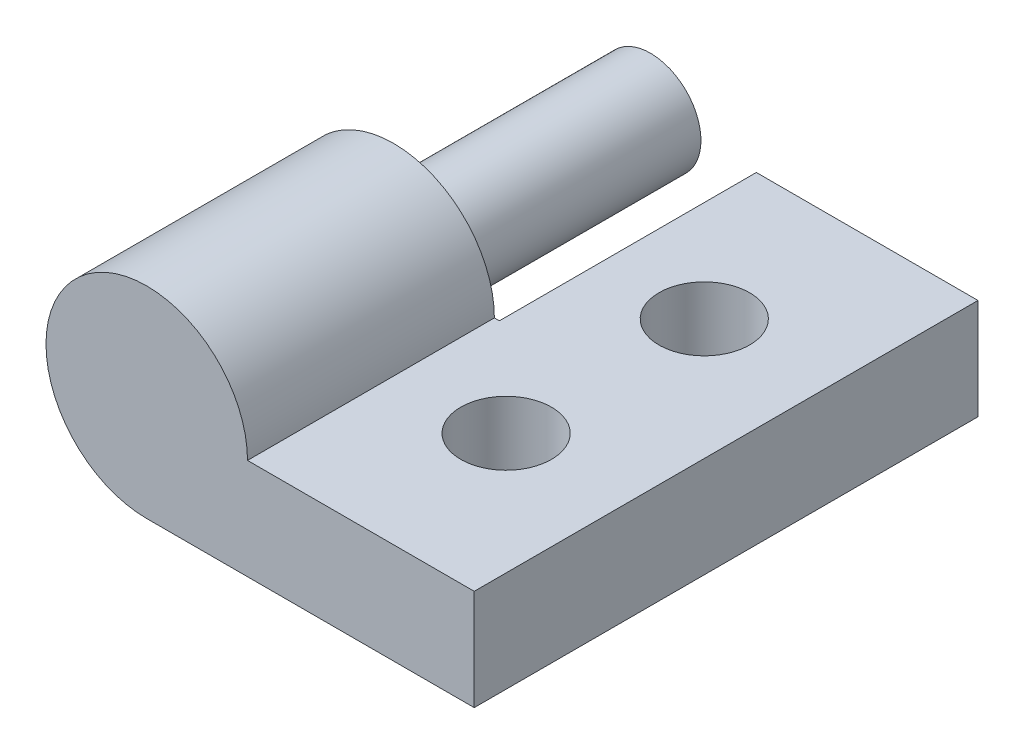
ISO-10303-21;
HEADER;
FILE_DESCRIPTION(('STEP AP214'),'2;1');
FILE_NAME('part.step','',(''),(''),'','','');
FILE_SCHEMA(('AUTOMOTIVE_DESIGN { 1 0 10303 214 1 1 1 1 }'));
ENDSEC;
DATA;
#1=APPLICATION_CONTEXT('core data for automotive mechanical design processes');
#2=APPLICATION_PROTOCOL_DEFINITION('international standard','automotive_design',2000,#1);
#3=PRODUCT_CONTEXT('',#1,'mechanical');
#4=PRODUCT('Part','Part','',(#3));
#5=PRODUCT_RELATED_PRODUCT_CATEGORY('part','',(#4));
#6=PRODUCT_DEFINITION_FORMATION('','',#4);
#7=PRODUCT_DEFINITION_CONTEXT('part definition',#1,'design');
#8=PRODUCT_DEFINITION('design','',#6,#7);
#9=PRODUCT_DEFINITION_SHAPE('','',#8);
#10=(LENGTH_UNIT() NAMED_UNIT(*) SI_UNIT(.MILLI.,.METRE.));
#11=(NAMED_UNIT(*) PLANE_ANGLE_UNIT() SI_UNIT($,.RADIAN.));
#12=(NAMED_UNIT(*) SI_UNIT($,.STERADIAN.) SOLID_ANGLE_UNIT());
#13=UNCERTAINTY_MEASURE_WITH_UNIT(LENGTH_MEASURE(1.E-05),#10,'distance_accuracy_value','');
#14=(GEOMETRIC_REPRESENTATION_CONTEXT(3) GLOBAL_UNCERTAINTY_ASSIGNED_CONTEXT((#13)) GLOBAL_UNIT_ASSIGNED_CONTEXT((#10,
#11,#12)) REPRESENTATION_CONTEXT('',''));
#15=CARTESIAN_POINT('',(0.,0.,0.));
#16=DIRECTION('',(0.,0.,1.));
#17=DIRECTION('',(1.,0.,0.));
#18=AXIS2_PLACEMENT_3D('',#15,#16,#17);
#19=CARTESIAN_POINT('',(-16.51,5.08,25.4));
#20=DIRECTION('',(0.,0.,-1.));
#21=DIRECTION('',(-1.,0.,0.));
#22=AXIS2_PLACEMENT_3D('',#19,#20,#21);
#23=CYLINDRICAL_SURFACE('',#22,5.08);
#24=CARTESIAN_POINT('',(-16.51,5.08,12.954));
#25=DIRECTION('',(0.,0.,-1.));
#26=DIRECTION('',(-1.,0.,0.));
#27=AXIS2_PLACEMENT_3D('',#24,#25,#26);
#28=CIRCLE('',#27,5.08);
#29=CARTESIAN_POINT('',(-16.51,0.,12.954));
#30=VERTEX_POINT('',#29);
#31=CARTESIAN_POINT('',(-11.43,5.08,12.954));
#32=VERTEX_POINT('',#31);
#33=EDGE_CURVE('E72',#30,#32,#28,.T.);
#34=ORIENTED_EDGE('',*,*,#33,.F.);
#35=DIRECTION('',(0.,0.,-1.));
#36=VECTOR('',#35,1.);
#37=CARTESIAN_POINT('',(-16.51,0.,25.4));
#38=LINE('',#37,#36);
#39=CARTESIAN_POINT('',(-16.51,0.,25.4));
#40=VERTEX_POINT('',#39);
#41=EDGE_CURVE('E97',#40,#30,#38,.T.);
#42=ORIENTED_EDGE('',*,*,#41,.F.);
#43=CARTESIAN_POINT('',(-16.51,5.08,25.4));
#44=DIRECTION('',(0.,0.,1.));
#45=DIRECTION('',(1.,0.,0.));
#46=AXIS2_PLACEMENT_3D('',#43,#44,#45);
#47=CIRCLE('',#46,5.08);
#48=CARTESIAN_POINT('',(-11.43,5.08,25.4));
#49=VERTEX_POINT('',#48);
#50=EDGE_CURVE('E84',#49,#40,#47,.T.);
#51=ORIENTED_EDGE('',*,*,#50,.F.);
#52=DIRECTION('',(0.,0.,-1.));
#53=VECTOR('',#52,1.);
#54=CARTESIAN_POINT('',(-11.43,5.08,25.4));
#55=LINE('',#54,#53);
#56=EDGE_CURVE('E92',#49,#32,#55,.T.);
#57=ORIENTED_EDGE('',*,*,#56,.T.);
#58=EDGE_LOOP('',(#34,#42,#51,#57));
#59=FACE_BOUND('',#58,.T.);
#60=ADVANCED_FACE('F33',(#59),#23,.T.);
#61=CARTESIAN_POINT('',(0.,0.,25.4));
#62=DIRECTION('',(-1.,0.,0.));
#63=DIRECTION('',(0.,0.,1.));
#64=AXIS2_PLACEMENT_3D('',#61,#62,#63);
#65=PLANE('',#64);
#66=DIRECTION('',(0.,1.,0.));
#67=VECTOR('',#66,1.);
#68=CARTESIAN_POINT('',(0.,0.,0.));
#69=LINE('',#68,#67);
#70=CARTESIAN_POINT('',(0.,0.,0.));
#71=VERTEX_POINT('',#70);
#72=CARTESIAN_POINT('',(0.,5.08,0.));
#73=VERTEX_POINT('',#72);
#74=EDGE_CURVE('E105',#71,#73,#69,.T.);
#75=ORIENTED_EDGE('',*,*,#74,.T.);
#76=DIRECTION('',(0.,0.,-1.));
#77=VECTOR('',#76,1.);
#78=CARTESIAN_POINT('',(0.,5.08,25.4));
#79=LINE('',#78,#77);
#80=CARTESIAN_POINT('',(0.,5.08,25.4));
#81=VERTEX_POINT('',#80);
#82=EDGE_CURVE('E42',#81,#73,#79,.T.);
#83=ORIENTED_EDGE('',*,*,#82,.F.);
#84=DIRECTION('',(0.,1.,0.));
#85=VECTOR('',#84,1.);
#86=CARTESIAN_POINT('',(0.,0.,25.4));
#87=LINE('',#86,#85);
#88=CARTESIAN_POINT('',(0.,0.,25.4));
#89=VERTEX_POINT('',#88);
#90=EDGE_CURVE('E87',#89,#81,#87,.T.);
#91=ORIENTED_EDGE('',*,*,#90,.F.);
#92=DIRECTION('',(0.,0.,-1.));
#93=VECTOR('',#92,1.);
#94=CARTESIAN_POINT('',(0.,0.,25.4));
#95=LINE('',#94,#93);
#96=EDGE_CURVE('E101',#89,#71,#95,.T.);
#97=ORIENTED_EDGE('',*,*,#96,.T.);
#98=EDGE_LOOP('',(#75,#83,#91,#97));
#99=FACE_BOUND('',#98,.T.);
#100=ADVANCED_FACE('F35',(#99),#65,.F.);
#101=CARTESIAN_POINT('',(0.,5.08,25.4));
#102=DIRECTION('',(0.,-1.,0.));
#103=DIRECTION('',(1.,0.,0.));
#104=AXIS2_PLACEMENT_3D('',#101,#102,#103);
#105=PLANE('',#104);
#106=CARTESIAN_POINT('',(-6.096,5.08,17.6953333333333));
#107=DIRECTION('',(0.,1.,0.));
#108=DIRECTION('',(-1.,0.,0.));
#109=AXIS2_PLACEMENT_3D('',#106,#107,#108);
#110=CIRCLE('',#109,2.286);
#111=CARTESIAN_POINT('',(-8.382,5.08,17.6953333333333));
#112=VERTEX_POINT('',#111);
#113=EDGE_CURVE('E118',#112,#112,#110,.T.);
#114=ORIENTED_EDGE('',*,*,#113,.F.);
#115=EDGE_LOOP('',(#114));
#116=FACE_BOUND('',#115,.T.);
#117=CARTESIAN_POINT('',(-6.096,5.08,7.70466666666667));
#118=DIRECTION('',(0.,1.,0.));
#119=DIRECTION('',(-1.,0.,0.));
#120=AXIS2_PLACEMENT_3D('',#117,#118,#119);
#121=CIRCLE('',#120,2.286);
#122=CARTESIAN_POINT('',(-8.382,5.08,7.70466666666667));
#123=VERTEX_POINT('',#122);
#124=EDGE_CURVE('E159',#123,#123,#121,.T.);
#125=ORIENTED_EDGE('',*,*,#124,.F.);
#126=EDGE_LOOP('',(#125));
#127=FACE_BOUND('',#126,.T.);
#128=DIRECTION('',(-1.,0.,0.));
#129=VECTOR('',#128,1.);
#130=CARTESIAN_POINT('',(0.,5.08,0.));
#131=LINE('',#130,#129);
#132=CARTESIAN_POINT('',(-11.176,5.08,0.));
#133=VERTEX_POINT('',#132);
#134=EDGE_CURVE('E62',#73,#133,#131,.T.);
#135=ORIENTED_EDGE('',*,*,#134,.T.);
#136=DIRECTION('',(0.,0.,-1.));
#137=VECTOR('',#136,1.);
#138=CARTESIAN_POINT('',(-11.176,5.08,12.954));
#139=LINE('',#138,#137);
#140=CARTESIAN_POINT('',(-11.176,5.08,12.954));
#141=VERTEX_POINT('',#140);
#142=EDGE_CURVE('E165',#133,#141,#139,.F.);
#143=ORIENTED_EDGE('',*,*,#142,.T.);
#144=DIRECTION('',(1.,0.,0.));
#145=VECTOR('',#144,1.);
#146=CARTESIAN_POINT('',(0.,5.08,12.954));
#147=LINE('',#146,#145);
#148=EDGE_CURVE('E95',#32,#141,#147,.T.);
#149=ORIENTED_EDGE('',*,*,#148,.F.);
#150=ORIENTED_EDGE('',*,*,#56,.F.);
#151=DIRECTION('',(-1.,0.,0.));
#152=VECTOR('',#151,1.);
#153=CARTESIAN_POINT('',(0.,5.08,25.4));
#154=LINE('',#153,#152);
#155=EDGE_CURVE('E80',#81,#49,#154,.T.);
#156=ORIENTED_EDGE('',*,*,#155,.F.);
#157=ORIENTED_EDGE('',*,*,#82,.T.);
#158=EDGE_LOOP('',(#135,#143,#149,#150,#156,#157));
#159=FACE_BOUND('',#158,.T.);
#160=ADVANCED_FACE('F93',(#116,#127,#159),#105,.F.);
#161=CARTESIAN_POINT('',(0.,0.,25.4));
#162=DIRECTION('',(0.,1.,0.));
#163=DIRECTION('',(-1.,0.,0.));
#164=AXIS2_PLACEMENT_3D('',#161,#162,#163);
#165=PLANE('',#164);
#166=CARTESIAN_POINT('',(-6.096,0.,17.6953333333333));
#167=DIRECTION('',(0.,1.,0.));
#168=DIRECTION('',(-1.,0.,0.));
#169=AXIS2_PLACEMENT_3D('',#166,#167,#168);
#170=CIRCLE('',#169,2.286);
#171=CARTESIAN_POINT('',(-8.382,0.,17.6953333333333));
#172=VERTEX_POINT('',#171);
#173=EDGE_CURVE('E108',#172,#172,#170,.T.);
#174=ORIENTED_EDGE('',*,*,#173,.T.);
#175=EDGE_LOOP('',(#174));
#176=FACE_BOUND('',#175,.T.);
#177=CARTESIAN_POINT('',(-6.096,0.,7.70466666666667));
#178=DIRECTION('',(0.,1.,0.));
#179=DIRECTION('',(-1.,0.,0.));
#180=AXIS2_PLACEMENT_3D('',#177,#178,#179);
#181=CIRCLE('',#180,2.286);
#182=CARTESIAN_POINT('',(-8.382,0.,7.70466666666667));
#183=VERTEX_POINT('',#182);
#184=EDGE_CURVE('E116',#183,#183,#181,.T.);
#185=ORIENTED_EDGE('',*,*,#184,.T.);
#186=EDGE_LOOP('',(#185));
#187=FACE_BOUND('',#186,.T.);
#188=DIRECTION('',(-1.,0.,0.));
#189=VECTOR('',#188,1.);
#190=CARTESIAN_POINT('',(0.,0.,12.954));
#191=LINE('',#190,#189);
#192=CARTESIAN_POINT('',(-11.176,0.,12.954));
#193=VERTEX_POINT('',#192);
#194=EDGE_CURVE('E11',#193,#30,#191,.T.);
#195=ORIENTED_EDGE('',*,*,#194,.F.);
#196=DIRECTION('',(0.,0.,-1.));
#197=VECTOR('',#196,1.);
#198=CARTESIAN_POINT('',(-11.176,0.,19.2430973550508));
#199=LINE('',#198,#197);
#200=CARTESIAN_POINT('',(-11.176,0.,0.));
#201=VERTEX_POINT('',#200);
#202=EDGE_CURVE('E176',#193,#201,#199,.T.);
#203=ORIENTED_EDGE('',*,*,#202,.T.);
#204=DIRECTION('',(1.,0.,0.));
#205=VECTOR('',#204,1.);
#206=CARTESIAN_POINT('',(0.,0.,0.));
#207=LINE('',#206,#205);
#208=EDGE_CURVE('E110',#201,#71,#207,.T.);
#209=ORIENTED_EDGE('',*,*,#208,.T.);
#210=ORIENTED_EDGE('',*,*,#96,.F.);
#211=DIRECTION('',(1.,0.,0.));
#212=VECTOR('',#211,1.);
#213=CARTESIAN_POINT('',(0.,0.,25.4));
#214=LINE('',#213,#212);
#215=EDGE_CURVE('E50',#40,#89,#214,.T.);
#216=ORIENTED_EDGE('',*,*,#215,.F.);
#217=ORIENTED_EDGE('',*,*,#41,.T.);
#218=EDGE_LOOP('',(#195,#203,#209,#210,#216,#217));
#219=FACE_BOUND('',#218,.T.);
#220=ADVANCED_FACE('F122',(#176,#187,#219),#165,.F.);
#221=CARTESIAN_POINT('',(-16.51,5.08,25.4));
#222=DIRECTION('',(0.,0.,1.));
#223=DIRECTION('',(1.,0.,0.));
#224=AXIS2_PLACEMENT_3D('',#221,#222,#223);
#225=PLANE('',#224);
#226=ORIENTED_EDGE('',*,*,#90,.T.);
#227=ORIENTED_EDGE('',*,*,#155,.T.);
#228=ORIENTED_EDGE('',*,*,#50,.T.);
#229=ORIENTED_EDGE('',*,*,#215,.T.);
#230=EDGE_LOOP('',(#226,#227,#228,#229));
#231=FACE_BOUND('',#230,.T.);
#232=ADVANCED_FACE('F82',(#231),#225,.T.);
#233=CARTESIAN_POINT('',(-16.51,5.08,0.));
#234=DIRECTION('',(0.,0.,1.));
#235=DIRECTION('',(1.,0.,0.));
#236=AXIS2_PLACEMENT_3D('',#233,#234,#235);
#237=PLANE('',#236);
#238=ORIENTED_EDGE('',*,*,#208,.F.);
#239=DIRECTION('',(0.,-1.,0.));
#240=VECTOR('',#239,1.);
#241=CARTESIAN_POINT('',(-11.176,5.08,0.));
#242=LINE('',#241,#240);
#243=EDGE_CURVE('E179',#133,#201,#242,.T.);
#244=ORIENTED_EDGE('',*,*,#243,.F.);
#245=ORIENTED_EDGE('',*,*,#134,.F.);
#246=ORIENTED_EDGE('',*,*,#74,.F.);
#247=EDGE_LOOP('',(#238,#244,#245,#246));
#248=FACE_BOUND('',#247,.T.);
#249=ADVANCED_FACE('F138',(#248),#237,.F.);
#250=CARTESIAN_POINT('',(-6.096,-7.874,7.70466666666667));
#251=DIRECTION('',(0.,1.,0.));
#252=DIRECTION('',(-1.,0.,0.));
#253=AXIS2_PLACEMENT_3D('',#250,#251,#252);
#254=CYLINDRICAL_SURFACE('',#253,2.286);
#255=ORIENTED_EDGE('',*,*,#124,.T.);
#256=EDGE_LOOP('',(#255));
#257=FACE_BOUND('',#256,.T.);
#258=ORIENTED_EDGE('',*,*,#184,.F.);
#259=EDGE_LOOP('',(#258));
#260=FACE_BOUND('',#259,.T.);
#261=ADVANCED_FACE('F128',(#257,#260),#254,.F.);
#262=CARTESIAN_POINT('',(-6.096,-7.874,17.6953333333333));
#263=DIRECTION('',(0.,1.,0.));
#264=DIRECTION('',(-1.,0.,0.));
#265=AXIS2_PLACEMENT_3D('',#262,#263,#264);
#266=CYLINDRICAL_SURFACE('',#265,2.286);
#267=ORIENTED_EDGE('',*,*,#113,.T.);
#268=EDGE_LOOP('',(#267));
#269=FACE_BOUND('',#268,.T.);
#270=ORIENTED_EDGE('',*,*,#173,.F.);
#271=EDGE_LOOP('',(#270));
#272=FACE_BOUND('',#271,.T.);
#273=ADVANCED_FACE('F125',(#269,#272),#266,.F.);
#274=CARTESIAN_POINT('',(-16.51,5.08,12.954));
#275=DIRECTION('',(0.,0.,-1.));
#276=DIRECTION('',(-1.,0.,0.));
#277=AXIS2_PLACEMENT_3D('',#274,#275,#276);
#278=PLANE('',#277);
#279=CARTESIAN_POINT('',(-16.51,5.08,12.954));
#280=DIRECTION('',(0.,0.,-1.));
#281=DIRECTION('',(-1.,0.,0.));
#282=AXIS2_PLACEMENT_3D('',#279,#280,#281);
#283=CIRCLE('',#282,2.54);
#284=CARTESIAN_POINT('',(-19.05,5.08,12.954));
#285=VERTEX_POINT('',#284);
#286=EDGE_CURVE('E168',#285,#285,#283,.T.);
#287=ORIENTED_EDGE('',*,*,#286,.F.);
#288=EDGE_LOOP('',(#287));
#289=FACE_BOUND('',#288,.T.);
#290=ORIENTED_EDGE('',*,*,#148,.T.);
#291=DIRECTION('',(0.,1.,0.));
#292=VECTOR('',#291,1.);
#293=CARTESIAN_POINT('',(-11.176,5.08,12.954));
#294=LINE('',#293,#292);
#295=EDGE_CURVE('E171',#193,#141,#294,.T.);
#296=ORIENTED_EDGE('',*,*,#295,.F.);
#297=ORIENTED_EDGE('',*,*,#194,.T.);
#298=ORIENTED_EDGE('',*,*,#33,.T.);
#299=EDGE_LOOP('',(#290,#296,#297,#298));
#300=FACE_BOUND('',#299,.T.);
#301=ADVANCED_FACE('F127',(#289,#300),#278,.T.);
#302=CARTESIAN_POINT('',(-16.51,5.08,0.));
#303=DIRECTION('',(0.,0.,1.));
#304=DIRECTION('',(1.,0.,0.));
#305=AXIS2_PLACEMENT_3D('',#302,#303,#304);
#306=CYLINDRICAL_SURFACE('',#305,2.54);
#307=CARTESIAN_POINT('',(-16.51,5.08,0.));
#308=DIRECTION('',(0.,0.,-1.));
#309=DIRECTION('',(-1.,0.,0.));
#310=AXIS2_PLACEMENT_3D('',#307,#308,#309);
#311=CIRCLE('',#310,2.54);
#312=CARTESIAN_POINT('',(-19.05,5.08,0.));
#313=VERTEX_POINT('',#312);
#314=EDGE_CURVE('E167',#313,#313,#311,.T.);
#315=ORIENTED_EDGE('',*,*,#314,.F.);
#316=EDGE_LOOP('',(#315));
#317=FACE_BOUND('',#316,.T.);
#318=ORIENTED_EDGE('',*,*,#286,.T.);
#319=EDGE_LOOP('',(#318));
#320=FACE_BOUND('',#319,.T.);
#321=ADVANCED_FACE('F135',(#317,#320),#306,.T.);
#322=CARTESIAN_POINT('',(-16.51,5.08,0.));
#323=DIRECTION('',(0.,0.,-1.));
#324=DIRECTION('',(-1.,0.,0.));
#325=AXIS2_PLACEMENT_3D('',#322,#323,#324);
#326=PLANE('',#325);
#327=ORIENTED_EDGE('',*,*,#314,.T.);
#328=EDGE_LOOP('',(#327));
#329=FACE_BOUND('',#328,.T.);
#330=ADVANCED_FACE('F233',(#329),#326,.T.);
#331=CARTESIAN_POINT('',(-11.176,5.08,19.2430973550508));
#332=DIRECTION('',(1.,0.,0.));
#333=DIRECTION('',(0.,0.,-1.));
#334=AXIS2_PLACEMENT_3D('',#331,#332,#333);
#335=PLANE('',#334);
#336=ORIENTED_EDGE('',*,*,#295,.T.);
#337=ORIENTED_EDGE('',*,*,#142,.F.);
#338=ORIENTED_EDGE('',*,*,#243,.T.);
#339=ORIENTED_EDGE('',*,*,#202,.F.);
#340=EDGE_LOOP('',(#336,#337,#338,#339));
#341=FACE_BOUND('',#340,.T.);
#342=ADVANCED_FACE('F185',(#341),#335,.F.);
#343=CLOSED_SHELL('',(#60,#100,#160,#220,#232,#249,#261,#273,#301,#321,#330,#342));
#344=MANIFOLD_SOLID_BREP('B2',#343);
#345=ADVANCED_BREP_SHAPE_REPRESENTATION('',(#18,#344),#14);
#346=SHAPE_DEFINITION_REPRESENTATION(#9,#345);
ENDSEC;
END-ISO-10303-21;
